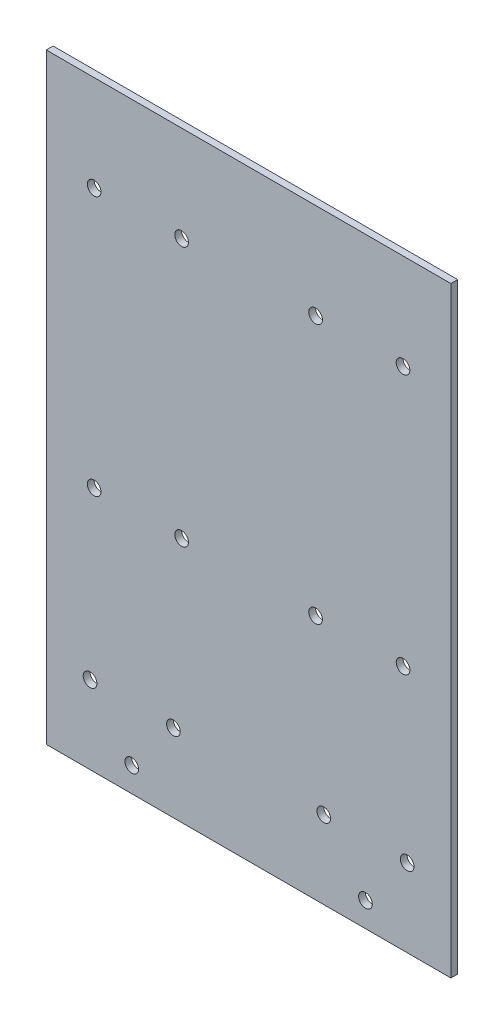
ISO-10303-21;
HEADER;
FILE_DESCRIPTION(('STEP AP214'),'2;1');
FILE_NAME('part.step','',(''),(''),'','','');
FILE_SCHEMA(('AUTOMOTIVE_DESIGN { 1 0 10303 214 1 1 1 1 }'));
ENDSEC;
DATA;
#1=APPLICATION_CONTEXT('core data for automotive mechanical design processes');
#2=APPLICATION_PROTOCOL_DEFINITION('international standard','automotive_design',2000,#1);
#3=PRODUCT_CONTEXT('',#1,'mechanical');
#4=PRODUCT('Part','Part','',(#3));
#5=PRODUCT_RELATED_PRODUCT_CATEGORY('part','',(#4));
#6=PRODUCT_DEFINITION_FORMATION('','',#4);
#7=PRODUCT_DEFINITION_CONTEXT('part definition',#1,'design');
#8=PRODUCT_DEFINITION('design','',#6,#7);
#9=PRODUCT_DEFINITION_SHAPE('','',#8);
#10=(LENGTH_UNIT() NAMED_UNIT(*) SI_UNIT(.MILLI.,.METRE.));
#11=(NAMED_UNIT(*) PLANE_ANGLE_UNIT() SI_UNIT($,.RADIAN.));
#12=(NAMED_UNIT(*) SI_UNIT($,.STERADIAN.) SOLID_ANGLE_UNIT());
#13=UNCERTAINTY_MEASURE_WITH_UNIT(LENGTH_MEASURE(1.E-05),#10,'distance_accuracy_value','');
#14=(GEOMETRIC_REPRESENTATION_CONTEXT(3) GLOBAL_UNCERTAINTY_ASSIGNED_CONTEXT((#13)) GLOBAL_UNIT_ASSIGNED_CONTEXT((#10,
#11,#12)) REPRESENTATION_CONTEXT('',''));
#15=CARTESIAN_POINT('',(0.,0.,0.));
#16=DIRECTION('',(0.,0.,1.));
#17=DIRECTION('',(1.,0.,0.));
#18=AXIS2_PLACEMENT_3D('',#15,#16,#17);
#19=CARTESIAN_POINT('',(0.,0.,2.5));
#20=DIRECTION('',(0.,0.,1.));
#21=DIRECTION('',(1.,0.,0.));
#22=AXIS2_PLACEMENT_3D('',#19,#20,#21);
#23=PLANE('',#22);
#24=CARTESIAN_POINT('',(24.4999999999996,75.,2.5));
#25=DIRECTION('',(0.,0.,1.));
#26=DIRECTION('',(-1.,0.,0.));
#27=AXIS2_PLACEMENT_3D('',#24,#25,#26);
#28=CIRCLE('',#27,2.5);
#29=CARTESIAN_POINT('',(21.9999999999996,75.,2.5));
#30=VERTEX_POINT('',#29);
#31=EDGE_CURVE('E406',#30,#30,#28,.T.);
#32=ORIENTED_EDGE('',*,*,#31,.F.);
#33=EDGE_LOOP('',(#32));
#34=FACE_BOUND('',#33,.T.);
#35=CARTESIAN_POINT('',(-24.5,-20.,2.5));
#36=DIRECTION('',(0.,0.,1.));
#37=DIRECTION('',(1.,0.,0.));
#38=AXIS2_PLACEMENT_3D('',#35,#36,#37);
#39=CIRCLE('',#38,2.5);
#40=CARTESIAN_POINT('',(-22.,-20.,2.5));
#41=VERTEX_POINT('',#40);
#42=EDGE_CURVE('E418',#41,#41,#39,.T.);
#43=ORIENTED_EDGE('',*,*,#42,.F.);
#44=EDGE_LOOP('',(#43));
#45=FACE_BOUND('',#44,.T.);
#46=CARTESIAN_POINT('',(-56.5000000000003,75.,2.5));
#47=DIRECTION('',(0.,0.,1.));
#48=DIRECTION('',(1.,0.,0.));
#49=AXIS2_PLACEMENT_3D('',#46,#47,#48);
#50=CIRCLE('',#49,2.50000000000001);
#51=CARTESIAN_POINT('',(-54.0000000000003,75.,2.5));
#52=VERTEX_POINT('',#51);
#53=EDGE_CURVE('E411',#52,#52,#50,.T.);
#54=ORIENTED_EDGE('',*,*,#53,.F.);
#55=EDGE_LOOP('',(#54));
#56=FACE_BOUND('',#55,.T.);
#57=CARTESIAN_POINT('',(-24.5000000000003,75.,2.5));
#58=DIRECTION('',(0.,0.,1.));
#59=DIRECTION('',(1.,0.,0.));
#60=AXIS2_PLACEMENT_3D('',#57,#58,#59);
#61=CIRCLE('',#60,2.5);
#62=CARTESIAN_POINT('',(-22.0000000000003,75.,2.5));
#63=VERTEX_POINT('',#62);
#64=EDGE_CURVE('E407',#63,#63,#61,.T.);
#65=ORIENTED_EDGE('',*,*,#64,.F.);
#66=EDGE_LOOP('',(#65));
#67=FACE_BOUND('',#66,.T.);
#68=CARTESIAN_POINT('',(56.4999999999993,-20.,2.5));
#69=DIRECTION('',(0.,0.,1.));
#70=DIRECTION('',(-1.,0.,0.));
#71=AXIS2_PLACEMENT_3D('',#68,#69,#70);
#72=CIRCLE('',#71,2.49999999999999);
#73=CARTESIAN_POINT('',(53.9999999999993,-20.,2.5));
#74=VERTEX_POINT('',#73);
#75=EDGE_CURVE('E437',#74,#74,#72,.T.);
#76=ORIENTED_EDGE('',*,*,#75,.F.);
#77=EDGE_LOOP('',(#76));
#78=FACE_BOUND('',#77,.T.);
#79=CARTESIAN_POINT('',(24.4999999999993,-20.,2.5));
#80=DIRECTION('',(0.,0.,1.));
#81=DIRECTION('',(-1.,0.,0.));
#82=AXIS2_PLACEMENT_3D('',#79,#80,#81);
#83=CIRCLE('',#82,2.5);
#84=CARTESIAN_POINT('',(21.9999999999993,-20.,2.5));
#85=VERTEX_POINT('',#84);
#86=EDGE_CURVE('E414',#85,#85,#83,.T.);
#87=ORIENTED_EDGE('',*,*,#86,.F.);
#88=EDGE_LOOP('',(#87));
#89=FACE_BOUND('',#88,.T.);
#90=CARTESIAN_POINT('',(56.4999999999996,75.,2.5));
#91=DIRECTION('',(0.,0.,1.));
#92=DIRECTION('',(-1.,0.,0.));
#93=AXIS2_PLACEMENT_3D('',#90,#91,#92);
#94=CIRCLE('',#93,2.50000000000001);
#95=CARTESIAN_POINT('',(53.9999999999996,75.,2.5));
#96=VERTEX_POINT('',#95);
#97=EDGE_CURVE('E408',#96,#96,#94,.T.);
#98=ORIENTED_EDGE('',*,*,#97,.F.);
#99=EDGE_LOOP('',(#98));
#100=FACE_BOUND('',#99,.T.);
#101=CARTESIAN_POINT('',(-56.5,-20.,2.5));
#102=DIRECTION('',(0.,0.,1.));
#103=DIRECTION('',(1.,0.,0.));
#104=AXIS2_PLACEMENT_3D('',#101,#102,#103);
#105=CIRCLE('',#104,2.49999999999999);
#106=CARTESIAN_POINT('',(-54.,-20.,2.5));
#107=VERTEX_POINT('',#106);
#108=EDGE_CURVE('E117',#107,#107,#105,.T.);
#109=ORIENTED_EDGE('',*,*,#108,.F.);
#110=EDGE_LOOP('',(#109));
#111=FACE_BOUND('',#110,.T.);
#112=CARTESIAN_POINT('',(58.,-81.5,2.5));
#113=DIRECTION('',(0.,0.,1.));
#114=DIRECTION('',(-1.,0.,0.));
#115=AXIS2_PLACEMENT_3D('',#112,#113,#114);
#116=CIRCLE('',#115,2.50000000000001);
#117=CARTESIAN_POINT('',(55.5,-81.5,2.5));
#118=VERTEX_POINT('',#117);
#119=EDGE_CURVE('E149',#118,#118,#116,.T.);
#120=ORIENTED_EDGE('',*,*,#119,.F.);
#121=EDGE_LOOP('',(#120));
#122=FACE_BOUND('',#121,.T.);
#123=CARTESIAN_POINT('',(-42.75,-101.,2.5));
#124=DIRECTION('',(0.,0.,1.));
#125=DIRECTION('',(1.,0.,0.));
#126=AXIS2_PLACEMENT_3D('',#123,#124,#125);
#127=CIRCLE('',#126,2.5);
#128=CARTESIAN_POINT('',(-40.25,-101.,2.5));
#129=VERTEX_POINT('',#128);
#130=EDGE_CURVE('E161',#129,#129,#127,.T.);
#131=ORIENTED_EDGE('',*,*,#130,.F.);
#132=EDGE_LOOP('',(#131));
#133=FACE_BOUND('',#132,.T.);
#134=CARTESIAN_POINT('',(-58.,-81.5,2.5));
#135=DIRECTION('',(0.,0.,1.));
#136=DIRECTION('',(1.,0.,0.));
#137=AXIS2_PLACEMENT_3D('',#134,#135,#136);
#138=CIRCLE('',#137,2.50000000000001);
#139=CARTESIAN_POINT('',(-55.5,-81.5,2.5));
#140=VERTEX_POINT('',#139);
#141=EDGE_CURVE('E107',#140,#140,#138,.T.);
#142=ORIENTED_EDGE('',*,*,#141,.F.);
#143=EDGE_LOOP('',(#142));
#144=FACE_BOUND('',#143,.T.);
#145=DIRECTION('',(0.,-1.,0.));
#146=VECTOR('',#145,1.);
#147=CARTESIAN_POINT('',(-74.,-110.,2.5));
#148=LINE('',#147,#146);
#149=CARTESIAN_POINT('',(-74.,110.,2.5));
#150=VERTEX_POINT('',#149);
#151=CARTESIAN_POINT('',(-74.,-110.,2.5));
#152=VERTEX_POINT('',#151);
#153=EDGE_CURVE('E91',#150,#152,#148,.T.);
#154=ORIENTED_EDGE('',*,*,#153,.T.);
#155=DIRECTION('',(1.,0.,0.));
#156=VECTOR('',#155,1.);
#157=CARTESIAN_POINT('',(74.,-110.,2.5));
#158=LINE('',#157,#156);
#159=CARTESIAN_POINT('',(74.,-110.,2.5));
#160=VERTEX_POINT('',#159);
#161=EDGE_CURVE('E86',#152,#160,#158,.T.);
#162=ORIENTED_EDGE('',*,*,#161,.T.);
#163=DIRECTION('',(0.,1.,0.));
#164=VECTOR('',#163,1.);
#165=CARTESIAN_POINT('',(74.,-110.,2.5));
#166=LINE('',#165,#164);
#167=CARTESIAN_POINT('',(74.,110.,2.5));
#168=VERTEX_POINT('',#167);
#169=EDGE_CURVE('E89',#160,#168,#166,.T.);
#170=ORIENTED_EDGE('',*,*,#169,.T.);
#171=DIRECTION('',(-1.,0.,0.));
#172=VECTOR('',#171,1.);
#173=CARTESIAN_POINT('',(74.,110.,2.5));
#174=LINE('',#173,#172);
#175=EDGE_CURVE('E56',#168,#150,#174,.T.);
#176=ORIENTED_EDGE('',*,*,#175,.T.);
#177=EDGE_LOOP('',(#154,#162,#170,#176));
#178=FACE_BOUND('',#177,.T.);
#179=CARTESIAN_POINT('',(-27.5,-81.5,2.5));
#180=DIRECTION('',(0.,0.,1.));
#181=DIRECTION('',(1.,0.,0.));
#182=AXIS2_PLACEMENT_3D('',#179,#180,#181);
#183=CIRCLE('',#182,2.5);
#184=CARTESIAN_POINT('',(-25.,-81.5,2.5));
#185=VERTEX_POINT('',#184);
#186=EDGE_CURVE('E167',#185,#185,#183,.T.);
#187=ORIENTED_EDGE('',*,*,#186,.F.);
#188=EDGE_LOOP('',(#187));
#189=FACE_BOUND('',#188,.T.);
#190=CARTESIAN_POINT('',(42.75,-101.,2.5));
#191=DIRECTION('',(0.,0.,1.));
#192=DIRECTION('',(-1.,0.,0.));
#193=AXIS2_PLACEMENT_3D('',#190,#191,#192);
#194=CIRCLE('',#193,2.5);
#195=CARTESIAN_POINT('',(40.25,-101.,2.5));
#196=VERTEX_POINT('',#195);
#197=EDGE_CURVE('E155',#196,#196,#194,.T.);
#198=ORIENTED_EDGE('',*,*,#197,.F.);
#199=EDGE_LOOP('',(#198));
#200=FACE_BOUND('',#199,.T.);
#201=CARTESIAN_POINT('',(27.5,-81.5,2.5));
#202=DIRECTION('',(0.,0.,1.));
#203=DIRECTION('',(-1.,0.,0.));
#204=AXIS2_PLACEMENT_3D('',#201,#202,#203);
#205=CIRCLE('',#204,2.5);
#206=CARTESIAN_POINT('',(25.,-81.5,2.5));
#207=VERTEX_POINT('',#206);
#208=EDGE_CURVE('E140',#207,#207,#205,.T.);
#209=ORIENTED_EDGE('',*,*,#208,.F.);
#210=EDGE_LOOP('',(#209));
#211=FACE_BOUND('',#210,.T.);
#212=ADVANCED_FACE('F37',(#34,#45,#56,#67,#78,#89,#100,#111,#122,#133,#144,#178,#189,#200,#211),
#23,.T.);
#213=CARTESIAN_POINT('',(0.,0.,0.));
#214=DIRECTION('',(0.,0.,1.));
#215=DIRECTION('',(1.,0.,0.));
#216=AXIS2_PLACEMENT_3D('',#213,#214,#215);
#217=PLANE('',#216);
#218=CARTESIAN_POINT('',(24.4999999999996,75.,0.));
#219=DIRECTION('',(0.,0.,1.));
#220=DIRECTION('',(1.,0.,0.));
#221=AXIS2_PLACEMENT_3D('',#218,#219,#220);
#222=CIRCLE('',#221,2.5);
#223=CARTESIAN_POINT('',(26.9999999999996,75.,0.));
#224=VERTEX_POINT('',#223);
#225=EDGE_CURVE('E41',#224,#224,#222,.T.);
#226=ORIENTED_EDGE('',*,*,#225,.T.);
#227=EDGE_LOOP('',(#226));
#228=FACE_BOUND('',#227,.T.);
#229=CARTESIAN_POINT('',(-24.5,-20.,0.));
#230=DIRECTION('',(0.,0.,1.));
#231=DIRECTION('',(1.,0.,0.));
#232=AXIS2_PLACEMENT_3D('',#229,#230,#231);
#233=CIRCLE('',#232,2.5);
#234=CARTESIAN_POINT('',(-22.,-20.,0.));
#235=VERTEX_POINT('',#234);
#236=EDGE_CURVE('E131',#235,#235,#233,.T.);
#237=ORIENTED_EDGE('',*,*,#236,.T.);
#238=EDGE_LOOP('',(#237));
#239=FACE_BOUND('',#238,.T.);
#240=CARTESIAN_POINT('',(-56.5000000000003,75.,0.));
#241=DIRECTION('',(0.,0.,1.));
#242=DIRECTION('',(1.,0.,0.));
#243=AXIS2_PLACEMENT_3D('',#240,#241,#242);
#244=CIRCLE('',#243,2.50000000000001);
#245=CARTESIAN_POINT('',(-54.0000000000003,75.,0.));
#246=VERTEX_POINT('',#245);
#247=EDGE_CURVE('E129',#246,#246,#244,.T.);
#248=ORIENTED_EDGE('',*,*,#247,.T.);
#249=EDGE_LOOP('',(#248));
#250=FACE_BOUND('',#249,.T.);
#251=CARTESIAN_POINT('',(-24.5000000000003,75.,0.));
#252=DIRECTION('',(0.,0.,1.));
#253=DIRECTION('',(1.,0.,0.));
#254=AXIS2_PLACEMENT_3D('',#251,#252,#253);
#255=CIRCLE('',#254,2.5);
#256=CARTESIAN_POINT('',(-22.0000000000003,75.,0.));
#257=VERTEX_POINT('',#256);
#258=EDGE_CURVE('E126',#257,#257,#255,.T.);
#259=ORIENTED_EDGE('',*,*,#258,.T.);
#260=EDGE_LOOP('',(#259));
#261=FACE_BOUND('',#260,.T.);
#262=CARTESIAN_POINT('',(56.4999999999993,-20.,0.));
#263=DIRECTION('',(0.,0.,1.));
#264=DIRECTION('',(1.,0.,0.));
#265=AXIS2_PLACEMENT_3D('',#262,#263,#264);
#266=CIRCLE('',#265,2.49999999999999);
#267=CARTESIAN_POINT('',(58.9999999999993,-20.,0.));
#268=VERTEX_POINT('',#267);
#269=EDGE_CURVE('E123',#268,#268,#266,.T.);
#270=ORIENTED_EDGE('',*,*,#269,.T.);
#271=EDGE_LOOP('',(#270));
#272=FACE_BOUND('',#271,.T.);
#273=CARTESIAN_POINT('',(24.4999999999993,-20.,0.));
#274=DIRECTION('',(0.,0.,1.));
#275=DIRECTION('',(1.,0.,0.));
#276=AXIS2_PLACEMENT_3D('',#273,#274,#275);
#277=CIRCLE('',#276,2.5);
#278=CARTESIAN_POINT('',(26.9999999999993,-20.,0.));
#279=VERTEX_POINT('',#278);
#280=EDGE_CURVE('E120',#279,#279,#277,.T.);
#281=ORIENTED_EDGE('',*,*,#280,.T.);
#282=EDGE_LOOP('',(#281));
#283=FACE_BOUND('',#282,.T.);
#284=CARTESIAN_POINT('',(56.4999999999996,75.,0.));
#285=DIRECTION('',(0.,0.,1.));
#286=DIRECTION('',(1.,0.,0.));
#287=AXIS2_PLACEMENT_3D('',#284,#285,#286);
#288=CIRCLE('',#287,2.50000000000001);
#289=CARTESIAN_POINT('',(58.9999999999996,75.,0.));
#290=VERTEX_POINT('',#289);
#291=EDGE_CURVE('E116',#290,#290,#288,.T.);
#292=ORIENTED_EDGE('',*,*,#291,.T.);
#293=EDGE_LOOP('',(#292));
#294=FACE_BOUND('',#293,.T.);
#295=CARTESIAN_POINT('',(-56.5,-20.,0.));
#296=DIRECTION('',(0.,0.,1.));
#297=DIRECTION('',(1.,0.,0.));
#298=AXIS2_PLACEMENT_3D('',#295,#296,#297);
#299=CIRCLE('',#298,2.49999999999999);
#300=CARTESIAN_POINT('',(-54.,-20.,0.));
#301=VERTEX_POINT('',#300);
#302=EDGE_CURVE('E113',#301,#301,#299,.T.);
#303=ORIENTED_EDGE('',*,*,#302,.T.);
#304=EDGE_LOOP('',(#303));
#305=FACE_BOUND('',#304,.T.);
#306=DIRECTION('',(0.,-1.,0.));
#307=VECTOR('',#306,1.);
#308=CARTESIAN_POINT('',(-74.,-110.,0.));
#309=LINE('',#308,#307);
#310=CARTESIAN_POINT('',(-74.,110.,0.));
#311=VERTEX_POINT('',#310);
#312=CARTESIAN_POINT('',(-74.,-110.,0.));
#313=VERTEX_POINT('',#312);
#314=EDGE_CURVE('E104',#311,#313,#309,.T.);
#315=ORIENTED_EDGE('',*,*,#314,.F.);
#316=DIRECTION('',(-1.,0.,0.));
#317=VECTOR('',#316,1.);
#318=CARTESIAN_POINT('',(74.,110.,0.));
#319=LINE('',#318,#317);
#320=CARTESIAN_POINT('',(74.,110.,0.));
#321=VERTEX_POINT('',#320);
#322=EDGE_CURVE('E79',#321,#311,#319,.T.);
#323=ORIENTED_EDGE('',*,*,#322,.F.);
#324=DIRECTION('',(0.,1.,0.));
#325=VECTOR('',#324,1.);
#326=CARTESIAN_POINT('',(74.,-110.,0.));
#327=LINE('',#326,#325);
#328=CARTESIAN_POINT('',(74.,-110.,0.));
#329=VERTEX_POINT('',#328);
#330=EDGE_CURVE('E73',#329,#321,#327,.T.);
#331=ORIENTED_EDGE('',*,*,#330,.F.);
#332=DIRECTION('',(1.,0.,0.));
#333=VECTOR('',#332,1.);
#334=CARTESIAN_POINT('',(74.,-110.,0.));
#335=LINE('',#334,#333);
#336=EDGE_CURVE('E95',#313,#329,#335,.T.);
#337=ORIENTED_EDGE('',*,*,#336,.F.);
#338=EDGE_LOOP('',(#315,#323,#331,#337));
#339=FACE_BOUND('',#338,.T.);
#340=CARTESIAN_POINT('',(-58.,-81.5,0.));
#341=DIRECTION('',(0.,0.,1.));
#342=DIRECTION('',(1.,0.,0.));
#343=AXIS2_PLACEMENT_3D('',#340,#341,#342);
#344=CIRCLE('',#343,2.50000000000001);
#345=CARTESIAN_POINT('',(-55.5,-81.5,0.));
#346=VERTEX_POINT('',#345);
#347=EDGE_CURVE('E170',#346,#346,#344,.T.);
#348=ORIENTED_EDGE('',*,*,#347,.T.);
#349=EDGE_LOOP('',(#348));
#350=FACE_BOUND('',#349,.T.);
#351=CARTESIAN_POINT('',(-27.5,-81.5,0.));
#352=DIRECTION('',(0.,0.,1.));
#353=DIRECTION('',(1.,0.,0.));
#354=AXIS2_PLACEMENT_3D('',#351,#352,#353);
#355=CIRCLE('',#354,2.5);
#356=CARTESIAN_POINT('',(-25.,-81.5,0.));
#357=VERTEX_POINT('',#356);
#358=EDGE_CURVE('E164',#357,#357,#355,.T.);
#359=ORIENTED_EDGE('',*,*,#358,.T.);
#360=EDGE_LOOP('',(#359));
#361=FACE_BOUND('',#360,.T.);
#362=CARTESIAN_POINT('',(-42.75,-101.,0.));
#363=DIRECTION('',(0.,0.,1.));
#364=DIRECTION('',(1.,0.,0.));
#365=AXIS2_PLACEMENT_3D('',#362,#363,#364);
#366=CIRCLE('',#365,2.5);
#367=CARTESIAN_POINT('',(-40.25,-101.,0.));
#368=VERTEX_POINT('',#367);
#369=EDGE_CURVE('E158',#368,#368,#366,.T.);
#370=ORIENTED_EDGE('',*,*,#369,.T.);
#371=EDGE_LOOP('',(#370));
#372=FACE_BOUND('',#371,.T.);
#373=CARTESIAN_POINT('',(42.75,-101.,0.));
#374=DIRECTION('',(0.,0.,1.));
#375=DIRECTION('',(-1.,0.,0.));
#376=AXIS2_PLACEMENT_3D('',#373,#374,#375);
#377=CIRCLE('',#376,2.5);
#378=CARTESIAN_POINT('',(40.25,-101.,0.));
#379=VERTEX_POINT('',#378);
#380=EDGE_CURVE('E152',#379,#379,#377,.T.);
#381=ORIENTED_EDGE('',*,*,#380,.T.);
#382=EDGE_LOOP('',(#381));
#383=FACE_BOUND('',#382,.T.);
#384=CARTESIAN_POINT('',(58.,-81.5,0.));
#385=DIRECTION('',(0.,0.,1.));
#386=DIRECTION('',(-1.,0.,0.));
#387=AXIS2_PLACEMENT_3D('',#384,#385,#386);
#388=CIRCLE('',#387,2.50000000000001);
#389=CARTESIAN_POINT('',(55.5,-81.5,0.));
#390=VERTEX_POINT('',#389);
#391=EDGE_CURVE('E145',#390,#390,#388,.T.);
#392=ORIENTED_EDGE('',*,*,#391,.T.);
#393=EDGE_LOOP('',(#392));
#394=FACE_BOUND('',#393,.T.);
#395=CARTESIAN_POINT('',(27.5,-81.5,0.));
#396=DIRECTION('',(0.,0.,1.));
#397=DIRECTION('',(-1.,0.,0.));
#398=AXIS2_PLACEMENT_3D('',#395,#396,#397);
#399=CIRCLE('',#398,2.5);
#400=CARTESIAN_POINT('',(25.,-81.5,0.));
#401=VERTEX_POINT('',#400);
#402=EDGE_CURVE('E136',#401,#401,#399,.T.);
#403=ORIENTED_EDGE('',*,*,#402,.T.);
#404=EDGE_LOOP('',(#403));
#405=FACE_BOUND('',#404,.T.);
#406=ADVANCED_FACE('F178',(#228,#239,#250,#261,#272,#283,#294,#305,#339,#350,#361,#372,#383,
#394,#405),#217,.F.);
#407=CARTESIAN_POINT('',(-74.,-110.,2.5));
#408=DIRECTION('',(1.,0.,0.));
#409=DIRECTION('',(0.,1.,0.));
#410=AXIS2_PLACEMENT_3D('',#407,#408,#409);
#411=PLANE('',#410);
#412=ORIENTED_EDGE('',*,*,#314,.T.);
#413=DIRECTION('',(0.,0.,-1.));
#414=VECTOR('',#413,1.);
#415=CARTESIAN_POINT('',(-74.,-110.,2.5));
#416=LINE('',#415,#414);
#417=EDGE_CURVE('E11',#152,#313,#416,.T.);
#418=ORIENTED_EDGE('',*,*,#417,.F.);
#419=ORIENTED_EDGE('',*,*,#153,.F.);
#420=DIRECTION('',(0.,0.,-1.));
#421=VECTOR('',#420,1.);
#422=CARTESIAN_POINT('',(-74.,110.,2.5));
#423=LINE('',#422,#421);
#424=EDGE_CURVE('E100',#150,#311,#423,.T.);
#425=ORIENTED_EDGE('',*,*,#424,.T.);
#426=EDGE_LOOP('',(#412,#418,#419,#425));
#427=FACE_BOUND('',#426,.T.);
#428=ADVANCED_FACE('F39',(#427),#411,.F.);
#429=CARTESIAN_POINT('',(74.,-110.,2.5));
#430=DIRECTION('',(0.,1.,0.));
#431=DIRECTION('',(0.,0.,1.));
#432=AXIS2_PLACEMENT_3D('',#429,#430,#431);
#433=PLANE('',#432);
#434=ORIENTED_EDGE('',*,*,#336,.T.);
#435=DIRECTION('',(0.,0.,-1.));
#436=VECTOR('',#435,1.);
#437=CARTESIAN_POINT('',(74.,-110.,2.5));
#438=LINE('',#437,#436);
#439=EDGE_CURVE('E47',#160,#329,#438,.T.);
#440=ORIENTED_EDGE('',*,*,#439,.F.);
#441=ORIENTED_EDGE('',*,*,#161,.F.);
#442=ORIENTED_EDGE('',*,*,#417,.T.);
#443=EDGE_LOOP('',(#434,#440,#441,#442));
#444=FACE_BOUND('',#443,.T.);
#445=ADVANCED_FACE('F94',(#444),#433,.F.);
#446=CARTESIAN_POINT('',(74.,-110.,2.5));
#447=DIRECTION('',(-1.,0.,0.));
#448=DIRECTION('',(0.,-1.,0.));
#449=AXIS2_PLACEMENT_3D('',#446,#447,#448);
#450=PLANE('',#449);
#451=ORIENTED_EDGE('',*,*,#330,.T.);
#452=DIRECTION('',(0.,0.,-1.));
#453=VECTOR('',#452,1.);
#454=CARTESIAN_POINT('',(74.,110.,2.5));
#455=LINE('',#454,#453);
#456=EDGE_CURVE('E96',#168,#321,#455,.T.);
#457=ORIENTED_EDGE('',*,*,#456,.F.);
#458=ORIENTED_EDGE('',*,*,#169,.F.);
#459=ORIENTED_EDGE('',*,*,#439,.T.);
#460=EDGE_LOOP('',(#451,#457,#458,#459));
#461=FACE_BOUND('',#460,.T.);
#462=ADVANCED_FACE('F98',(#461),#450,.F.);
#463=CARTESIAN_POINT('',(74.,110.,2.5));
#464=DIRECTION('',(0.,-1.,0.));
#465=DIRECTION('',(0.,0.,-1.));
#466=AXIS2_PLACEMENT_3D('',#463,#464,#465);
#467=PLANE('',#466);
#468=ORIENTED_EDGE('',*,*,#322,.T.);
#469=ORIENTED_EDGE('',*,*,#424,.F.);
#470=ORIENTED_EDGE('',*,*,#175,.F.);
#471=ORIENTED_EDGE('',*,*,#456,.T.);
#472=EDGE_LOOP('',(#468,#469,#470,#471));
#473=FACE_BOUND('',#472,.T.);
#474=ADVANCED_FACE('F184',(#473),#467,.F.);
#475=CARTESIAN_POINT('',(-58.,-81.5,2.5));
#476=DIRECTION('',(0.,0.,-1.));
#477=DIRECTION('',(-1.,0.,0.));
#478=AXIS2_PLACEMENT_3D('',#475,#476,#477);
#479=CYLINDRICAL_SURFACE('',#478,2.50000000000001);
#480=ORIENTED_EDGE('',*,*,#141,.T.);
#481=EDGE_LOOP('',(#480));
#482=FACE_BOUND('',#481,.T.);
#483=ORIENTED_EDGE('',*,*,#347,.F.);
#484=EDGE_LOOP('',(#483));
#485=FACE_BOUND('',#484,.T.);
#486=ADVANCED_FACE('F181',(#482,#485),#479,.F.);
#487=CARTESIAN_POINT('',(-27.5,-81.5,2.5));
#488=DIRECTION('',(0.,0.,-1.));
#489=DIRECTION('',(-1.,0.,0.));
#490=AXIS2_PLACEMENT_3D('',#487,#488,#489);
#491=CYLINDRICAL_SURFACE('',#490,2.5);
#492=ORIENTED_EDGE('',*,*,#186,.T.);
#493=EDGE_LOOP('',(#492));
#494=FACE_BOUND('',#493,.T.);
#495=ORIENTED_EDGE('',*,*,#358,.F.);
#496=EDGE_LOOP('',(#495));
#497=FACE_BOUND('',#496,.T.);
#498=ADVANCED_FACE('F183',(#494,#497),#491,.F.);
#499=CARTESIAN_POINT('',(-42.75,-101.,2.5));
#500=DIRECTION('',(0.,0.,-1.));
#501=DIRECTION('',(-1.,0.,0.));
#502=AXIS2_PLACEMENT_3D('',#499,#500,#501);
#503=CYLINDRICAL_SURFACE('',#502,2.5);
#504=ORIENTED_EDGE('',*,*,#130,.T.);
#505=EDGE_LOOP('',(#504));
#506=FACE_BOUND('',#505,.T.);
#507=ORIENTED_EDGE('',*,*,#369,.F.);
#508=EDGE_LOOP('',(#507));
#509=FACE_BOUND('',#508,.T.);
#510=ADVANCED_FACE('F191',(#506,#509),#503,.F.);
#511=CARTESIAN_POINT('',(42.75,-101.,2.5));
#512=DIRECTION('',(0.,0.,-1.));
#513=DIRECTION('',(-1.,0.,0.));
#514=AXIS2_PLACEMENT_3D('',#511,#512,#513);
#515=CYLINDRICAL_SURFACE('',#514,2.5);
#516=ORIENTED_EDGE('',*,*,#197,.T.);
#517=EDGE_LOOP('',(#516));
#518=FACE_BOUND('',#517,.T.);
#519=ORIENTED_EDGE('',*,*,#380,.F.);
#520=EDGE_LOOP('',(#519));
#521=FACE_BOUND('',#520,.T.);
#522=ADVANCED_FACE('F329',(#518,#521),#515,.F.);
#523=CARTESIAN_POINT('',(58.,-81.5,2.5));
#524=DIRECTION('',(0.,0.,-1.));
#525=DIRECTION('',(-1.,0.,0.));
#526=AXIS2_PLACEMENT_3D('',#523,#524,#525);
#527=CYLINDRICAL_SURFACE('',#526,2.50000000000001);
#528=ORIENTED_EDGE('',*,*,#119,.T.);
#529=EDGE_LOOP('',(#528));
#530=FACE_BOUND('',#529,.T.);
#531=ORIENTED_EDGE('',*,*,#391,.F.);
#532=EDGE_LOOP('',(#531));
#533=FACE_BOUND('',#532,.T.);
#534=ADVANCED_FACE('F325',(#530,#533),#527,.F.);
#535=CARTESIAN_POINT('',(27.5,-81.5,2.5));
#536=DIRECTION('',(0.,0.,-1.));
#537=DIRECTION('',(-1.,0.,0.));
#538=AXIS2_PLACEMENT_3D('',#535,#536,#537);
#539=CYLINDRICAL_SURFACE('',#538,2.5);
#540=ORIENTED_EDGE('',*,*,#208,.T.);
#541=EDGE_LOOP('',(#540));
#542=FACE_BOUND('',#541,.T.);
#543=ORIENTED_EDGE('',*,*,#402,.F.);
#544=EDGE_LOOP('',(#543));
#545=FACE_BOUND('',#544,.T.);
#546=ADVANCED_FACE('F245',(#542,#545),#539,.F.);
#547=CARTESIAN_POINT('',(-56.5,-20.,-0.5));
#548=DIRECTION('',(0.,0.,1.));
#549=DIRECTION('',(1.,0.,0.));
#550=AXIS2_PLACEMENT_3D('',#547,#548,#549);
#551=CYLINDRICAL_SURFACE('',#550,2.49999999999999);
#552=ORIENTED_EDGE('',*,*,#108,.T.);
#553=EDGE_LOOP('',(#552));
#554=FACE_BOUND('',#553,.T.);
#555=ORIENTED_EDGE('',*,*,#302,.F.);
#556=EDGE_LOOP('',(#555));
#557=FACE_BOUND('',#556,.T.);
#558=ADVANCED_FACE('F239',(#554,#557),#551,.F.);
#559=CARTESIAN_POINT('',(56.4999999999996,75.,-0.5));
#560=DIRECTION('',(0.,0.,1.));
#561=DIRECTION('',(1.,0.,0.));
#562=AXIS2_PLACEMENT_3D('',#559,#560,#561);
#563=CYLINDRICAL_SURFACE('',#562,2.50000000000001);
#564=ORIENTED_EDGE('',*,*,#97,.T.);
#565=EDGE_LOOP('',(#564));
#566=FACE_BOUND('',#565,.T.);
#567=ORIENTED_EDGE('',*,*,#291,.F.);
#568=EDGE_LOOP('',(#567));
#569=FACE_BOUND('',#568,.T.);
#570=ADVANCED_FACE('F244',(#566,#569),#563,.F.);
#571=CARTESIAN_POINT('',(24.4999999999993,-20.,-0.5));
#572=DIRECTION('',(0.,0.,1.));
#573=DIRECTION('',(1.,0.,0.));
#574=AXIS2_PLACEMENT_3D('',#571,#572,#573);
#575=CYLINDRICAL_SURFACE('',#574,2.5);
#576=ORIENTED_EDGE('',*,*,#86,.T.);
#577=EDGE_LOOP('',(#576));
#578=FACE_BOUND('',#577,.T.);
#579=ORIENTED_EDGE('',*,*,#280,.F.);
#580=EDGE_LOOP('',(#579));
#581=FACE_BOUND('',#580,.T.);
#582=ADVANCED_FACE('F257',(#578,#581),#575,.F.);
#583=CARTESIAN_POINT('',(56.4999999999993,-20.,-0.5));
#584=DIRECTION('',(0.,0.,1.));
#585=DIRECTION('',(1.,0.,0.));
#586=AXIS2_PLACEMENT_3D('',#583,#584,#585);
#587=CYLINDRICAL_SURFACE('',#586,2.49999999999999);
#588=ORIENTED_EDGE('',*,*,#75,.T.);
#589=EDGE_LOOP('',(#588));
#590=FACE_BOUND('',#589,.T.);
#591=ORIENTED_EDGE('',*,*,#269,.F.);
#592=EDGE_LOOP('',(#591));
#593=FACE_BOUND('',#592,.T.);
#594=ADVANCED_FACE('F267',(#590,#593),#587,.F.);
#595=CARTESIAN_POINT('',(-24.5000000000003,75.,-0.5));
#596=DIRECTION('',(0.,0.,1.));
#597=DIRECTION('',(1.,0.,0.));
#598=AXIS2_PLACEMENT_3D('',#595,#596,#597);
#599=CYLINDRICAL_SURFACE('',#598,2.5);
#600=ORIENTED_EDGE('',*,*,#64,.T.);
#601=EDGE_LOOP('',(#600));
#602=FACE_BOUND('',#601,.T.);
#603=ORIENTED_EDGE('',*,*,#258,.F.);
#604=EDGE_LOOP('',(#603));
#605=FACE_BOUND('',#604,.T.);
#606=ADVANCED_FACE('F277',(#602,#605),#599,.F.);
#607=CARTESIAN_POINT('',(-56.5000000000003,75.,-0.5));
#608=DIRECTION('',(0.,0.,1.));
#609=DIRECTION('',(1.,0.,0.));
#610=AXIS2_PLACEMENT_3D('',#607,#608,#609);
#611=CYLINDRICAL_SURFACE('',#610,2.50000000000001);
#612=ORIENTED_EDGE('',*,*,#53,.T.);
#613=EDGE_LOOP('',(#612));
#614=FACE_BOUND('',#613,.T.);
#615=ORIENTED_EDGE('',*,*,#247,.F.);
#616=EDGE_LOOP('',(#615));
#617=FACE_BOUND('',#616,.T.);
#618=ADVANCED_FACE('F287',(#614,#617),#611,.F.);
#619=CARTESIAN_POINT('',(-24.5,-20.,-0.5));
#620=DIRECTION('',(0.,0.,1.));
#621=DIRECTION('',(1.,0.,0.));
#622=AXIS2_PLACEMENT_3D('',#619,#620,#621);
#623=CYLINDRICAL_SURFACE('',#622,2.5);
#624=ORIENTED_EDGE('',*,*,#42,.T.);
#625=EDGE_LOOP('',(#624));
#626=FACE_BOUND('',#625,.T.);
#627=ORIENTED_EDGE('',*,*,#236,.F.);
#628=EDGE_LOOP('',(#627));
#629=FACE_BOUND('',#628,.T.);
#630=ADVANCED_FACE('F297',(#626,#629),#623,.F.);
#631=CARTESIAN_POINT('',(24.4999999999996,75.,-0.5));
#632=DIRECTION('',(0.,0.,1.));
#633=DIRECTION('',(1.,0.,0.));
#634=AXIS2_PLACEMENT_3D('',#631,#632,#633);
#635=CYLINDRICAL_SURFACE('',#634,2.5);
#636=ORIENTED_EDGE('',*,*,#31,.T.);
#637=EDGE_LOOP('',(#636));
#638=FACE_BOUND('',#637,.T.);
#639=ORIENTED_EDGE('',*,*,#225,.F.);
#640=EDGE_LOOP('',(#639));
#641=FACE_BOUND('',#640,.T.);
#642=ADVANCED_FACE('F307',(#638,#641),#635,.F.);
#643=CLOSED_SHELL('',(#212,#406,#428,#445,#462,#474,#486,#498,#510,#522,#534,#546,#558,#570,
#582,#594,#606,#618,#630,#642));
#644=MANIFOLD_SOLID_BREP('B2',#643);
#645=ADVANCED_BREP_SHAPE_REPRESENTATION('',(#18,#644),#14);
#646=SHAPE_DEFINITION_REPRESENTATION(#9,#645);
ENDSEC;
END-ISO-10303-21;
